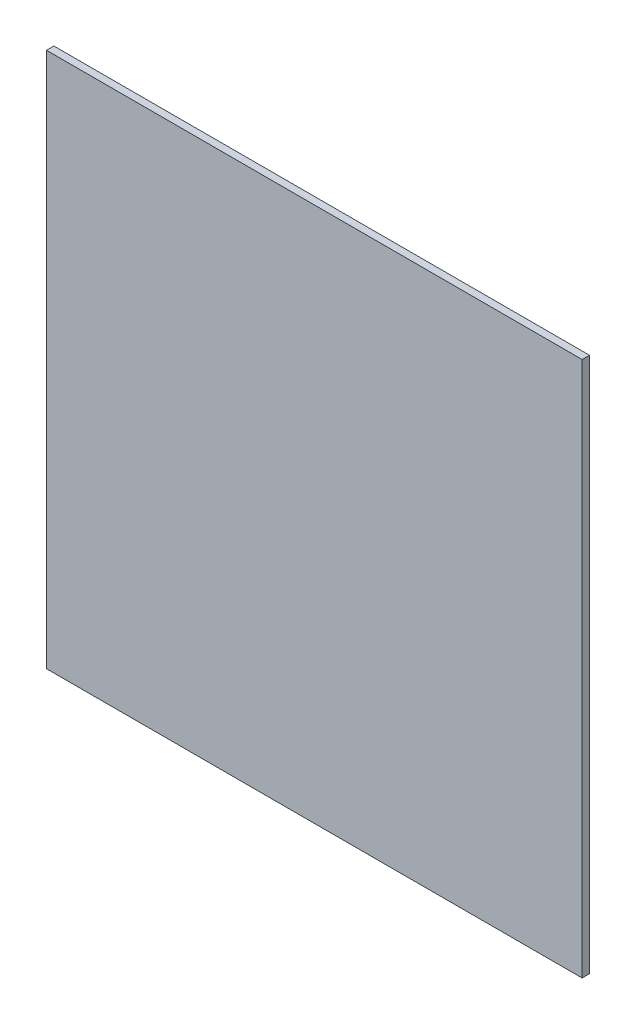
ISO-10303-21;
HEADER;
FILE_DESCRIPTION(('STEP AP214'),'2;1');
FILE_NAME('part.step','',(''),(''),'','','');
FILE_SCHEMA(('AUTOMOTIVE_DESIGN { 1 0 10303 214 1 1 1 1 }'));
ENDSEC;
DATA;
#1=APPLICATION_CONTEXT('core data for automotive mechanical design processes');
#2=APPLICATION_PROTOCOL_DEFINITION('international standard','automotive_design',2000,#1);
#3=PRODUCT_CONTEXT('',#1,'mechanical');
#4=PRODUCT('Part','Part','',(#3));
#5=PRODUCT_RELATED_PRODUCT_CATEGORY('part','',(#4));
#6=PRODUCT_DEFINITION_FORMATION('','',#4);
#7=PRODUCT_DEFINITION_CONTEXT('part definition',#1,'design');
#8=PRODUCT_DEFINITION('design','',#6,#7);
#9=PRODUCT_DEFINITION_SHAPE('','',#8);
#10=(LENGTH_UNIT() NAMED_UNIT(*) SI_UNIT(.MILLI.,.METRE.));
#11=(NAMED_UNIT(*) PLANE_ANGLE_UNIT() SI_UNIT($,.RADIAN.));
#12=(NAMED_UNIT(*) SI_UNIT($,.STERADIAN.) SOLID_ANGLE_UNIT());
#13=UNCERTAINTY_MEASURE_WITH_UNIT(LENGTH_MEASURE(1.E-05),#10,'distance_accuracy_value','');
#14=(GEOMETRIC_REPRESENTATION_CONTEXT(3) GLOBAL_UNCERTAINTY_ASSIGNED_CONTEXT((#13)) GLOBAL_UNIT_ASSIGNED_CONTEXT((#10,
#11,#12)) REPRESENTATION_CONTEXT('',''));
#15=CARTESIAN_POINT('',(0.,0.,0.));
#16=DIRECTION('',(0.,0.,1.));
#17=DIRECTION('',(1.,0.,0.));
#18=AXIS2_PLACEMENT_3D('',#15,#16,#17);
#19=CARTESIAN_POINT('',(-0.028320699595436,0.,0.0200000000000004));
#20=DIRECTION('',(0.,0.,1.));
#21=DIRECTION('',(1.,0.,0.));
#22=AXIS2_PLACEMENT_3D('',#19,#20,#21);
#23=PLANE('',#22);
#24=DIRECTION('',(1.,0.,0.));
#25=VECTOR('',#24,1.);
#26=CARTESIAN_POINT('',(-0.0283206995954357,-0.725,0.02));
#27=LINE('',#26,#25);
#28=CARTESIAN_POINT('',(-0.753320699595435,-0.725,0.02));
#29=VERTEX_POINT('',#28);
#30=CARTESIAN_POINT('',(0.696679300404564,-0.725,0.0200000000000006));
#31=VERTEX_POINT('',#30);
#32=EDGE_CURVE('E86',#29,#31,#27,.T.);
#33=ORIENTED_EDGE('',*,*,#32,.T.);
#34=DIRECTION('',(0.,-1.,0.));
#35=VECTOR('',#34,1.);
#36=CARTESIAN_POINT('',(0.696679300404564,0.,0.0200000000000004));
#37=LINE('',#36,#35);
#38=CARTESIAN_POINT('',(0.696679300404564,0.725,0.0200000000000004));
#39=VERTEX_POINT('',#38);
#40=EDGE_CURVE('E84',#39,#31,#37,.T.);
#41=ORIENTED_EDGE('',*,*,#40,.F.);
#42=DIRECTION('',(1.,0.,0.));
#43=VECTOR('',#42,1.);
#44=CARTESIAN_POINT('',(-0.0283206995954357,0.725,0.02));
#45=LINE('',#44,#43);
#46=CARTESIAN_POINT('',(-0.753320699595435,0.725,0.02));
#47=VERTEX_POINT('',#46);
#48=EDGE_CURVE('E85',#47,#39,#45,.T.);
#49=ORIENTED_EDGE('',*,*,#48,.F.);
#50=DIRECTION('',(0.,-1.,0.));
#51=VECTOR('',#50,1.);
#52=CARTESIAN_POINT('',(-0.753320699595435,0.,0.02));
#53=LINE('',#52,#51);
#54=EDGE_CURVE('E11',#47,#29,#53,.T.);
#55=ORIENTED_EDGE('',*,*,#54,.T.);
#56=EDGE_LOOP('',(#33,#41,#49,#55));
#57=FACE_BOUND('',#56,.T.);
#58=ADVANCED_FACE('F16',(#57),#23,.T.);
#59=CARTESIAN_POINT('',(-0.753320699595435,0.,0.01));
#60=DIRECTION('',(1.,0.,0.));
#61=DIRECTION('',(0.,0.,1.));
#62=AXIS2_PLACEMENT_3D('',#59,#60,#61);
#63=PLANE('',#62);
#64=DIRECTION('',(0.,0.,1.));
#65=VECTOR('',#64,1.);
#66=CARTESIAN_POINT('',(-0.753320699595435,0.725,0.0100000000000002));
#67=LINE('',#66,#65);
#68=CARTESIAN_POINT('',(-0.753320699595435,0.725,0.));
#69=VERTEX_POINT('',#68);
#70=EDGE_CURVE('E91',#69,#47,#67,.T.);
#71=ORIENTED_EDGE('',*,*,#70,.F.);
#72=DIRECTION('',(0.,-1.,0.));
#73=VECTOR('',#72,1.);
#74=CARTESIAN_POINT('',(-0.753320699595435,0.,0.));
#75=LINE('',#74,#73);
#76=CARTESIAN_POINT('',(-0.753320699595435,-0.725,0.));
#77=VERTEX_POINT('',#76);
#78=EDGE_CURVE('E20',#69,#77,#75,.T.);
#79=ORIENTED_EDGE('',*,*,#78,.T.);
#80=DIRECTION('',(0.,0.,1.));
#81=VECTOR('',#80,1.);
#82=CARTESIAN_POINT('',(-0.753320699595435,-0.725,0.0100000000000005));
#83=LINE('',#82,#81);
#84=EDGE_CURVE('E27',#77,#29,#83,.T.);
#85=ORIENTED_EDGE('',*,*,#84,.T.);
#86=ORIENTED_EDGE('',*,*,#54,.F.);
#87=EDGE_LOOP('',(#71,#79,#85,#86));
#88=FACE_BOUND('',#87,.T.);
#89=ADVANCED_FACE('F142',(#88),#63,.F.);
#90=CARTESIAN_POINT('',(-0.0283206995954357,-0.725,0.0100000000000005));
#91=DIRECTION('',(0.,1.,0.));
#92=DIRECTION('',(1.,0.,0.));
#93=AXIS2_PLACEMENT_3D('',#90,#91,#92);
#94=PLANE('',#93);
#95=DIRECTION('',(1.,0.,0.));
#96=VECTOR('',#95,1.);
#97=CARTESIAN_POINT('',(-0.0283206995954357,-0.725,0.));
#98=LINE('',#97,#96);
#99=CARTESIAN_POINT('',(0.696679300404564,-0.725,0.));
#100=VERTEX_POINT('',#99);
#101=EDGE_CURVE('E115',#77,#100,#98,.T.);
#102=ORIENTED_EDGE('',*,*,#101,.T.);
#103=DIRECTION('',(0.,0.,-1.));
#104=VECTOR('',#103,1.);
#105=CARTESIAN_POINT('',(0.696679300404564,-0.725,0.0100000000000007));
#106=LINE('',#105,#104);
#107=EDGE_CURVE('E90',#31,#100,#106,.T.);
#108=ORIENTED_EDGE('',*,*,#107,.F.);
#109=ORIENTED_EDGE('',*,*,#32,.F.);
#110=ORIENTED_EDGE('',*,*,#84,.F.);
#111=EDGE_LOOP('',(#102,#108,#109,#110));
#112=FACE_BOUND('',#111,.T.);
#113=ADVANCED_FACE('F18',(#112),#94,.F.);
#114=CARTESIAN_POINT('',(0.696679300404564,0.,0.0100000000000007));
#115=DIRECTION('',(1.,0.,0.));
#116=DIRECTION('',(0.,0.,-1.));
#117=AXIS2_PLACEMENT_3D('',#114,#115,#116);
#118=PLANE('',#117);
#119=DIRECTION('',(0.,1.,0.));
#120=VECTOR('',#119,1.);
#121=CARTESIAN_POINT('',(0.696679300404564,0.,0.));
#122=LINE('',#121,#120);
#123=CARTESIAN_POINT('',(0.696679300404564,0.725,0.));
#124=VERTEX_POINT('',#123);
#125=EDGE_CURVE('E96',#100,#124,#122,.T.);
#126=ORIENTED_EDGE('',*,*,#125,.T.);
#127=DIRECTION('',(0.,0.,-1.));
#128=VECTOR('',#127,1.);
#129=CARTESIAN_POINT('',(0.696679300404564,0.725,0.0100000000000002));
#130=LINE('',#129,#128);
#131=EDGE_CURVE('E63',#39,#124,#130,.T.);
#132=ORIENTED_EDGE('',*,*,#131,.F.);
#133=ORIENTED_EDGE('',*,*,#40,.T.);
#134=ORIENTED_EDGE('',*,*,#107,.T.);
#135=EDGE_LOOP('',(#126,#132,#133,#134));
#136=FACE_BOUND('',#135,.T.);
#137=ADVANCED_FACE('F94',(#136),#118,.T.);
#138=CARTESIAN_POINT('',(-0.0283206995954357,0.725,0.0100000000000002));
#139=DIRECTION('',(0.,1.,0.));
#140=DIRECTION('',(0.,0.,-1.));
#141=AXIS2_PLACEMENT_3D('',#138,#139,#140);
#142=PLANE('',#141);
#143=ORIENTED_EDGE('',*,*,#48,.T.);
#144=ORIENTED_EDGE('',*,*,#131,.T.);
#145=DIRECTION('',(-1.,0.,0.));
#146=VECTOR('',#145,1.);
#147=CARTESIAN_POINT('',(-0.0283206995954357,0.725,0.));
#148=LINE('',#147,#146);
#149=EDGE_CURVE('E100',#124,#69,#148,.T.);
#150=ORIENTED_EDGE('',*,*,#149,.T.);
#151=ORIENTED_EDGE('',*,*,#70,.T.);
#152=EDGE_LOOP('',(#143,#144,#150,#151));
#153=FACE_BOUND('',#152,.T.);
#154=ADVANCED_FACE('F98',(#153),#142,.T.);
#155=CARTESIAN_POINT('',(-0.0283206995954357,0.,0.));
#156=DIRECTION('',(0.,0.,1.));
#157=DIRECTION('',(1.,0.,0.));
#158=AXIS2_PLACEMENT_3D('',#155,#156,#157);
#159=PLANE('',#158);
#160=ORIENTED_EDGE('',*,*,#125,.F.);
#161=ORIENTED_EDGE('',*,*,#101,.F.);
#162=ORIENTED_EDGE('',*,*,#78,.F.);
#163=ORIENTED_EDGE('',*,*,#149,.F.);
#164=EDGE_LOOP('',(#160,#161,#162,#163));
#165=FACE_BOUND('',#164,.T.);
#166=ADVANCED_FACE('F168',(#165),#159,.F.);
#167=CLOSED_SHELL('',(#58,#89,#113,#137,#154,#166));
#168=MANIFOLD_SOLID_BREP('B1',#167);
#169=ADVANCED_BREP_SHAPE_REPRESENTATION('',(#18,#168),#14);
#170=SHAPE_DEFINITION_REPRESENTATION(#9,#169);
ENDSEC;
END-ISO-10303-21;
